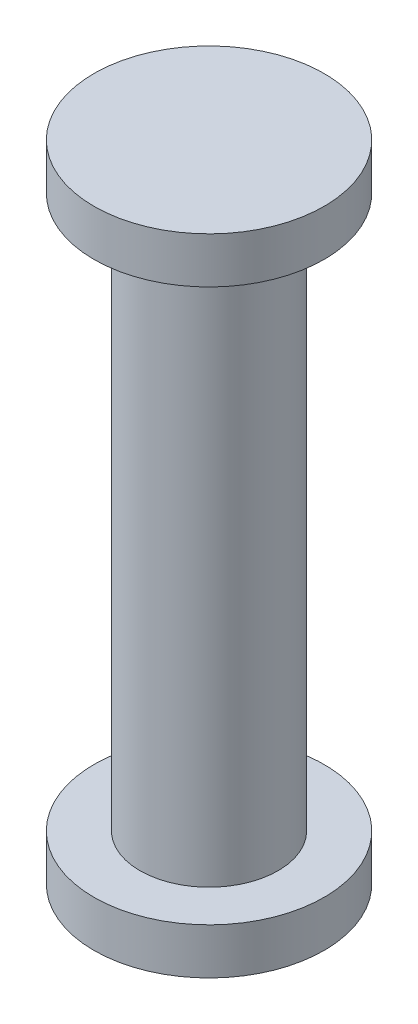
ISO-10303-21;
HEADER;
FILE_DESCRIPTION(('STEP AP214'),'2;1');
FILE_NAME('part.step','',(''),(''),'','','');
FILE_SCHEMA(('AUTOMOTIVE_DESIGN { 1 0 10303 214 1 1 1 1 }'));
ENDSEC;
DATA;
#1=APPLICATION_CONTEXT('core data for automotive mechanical design processes');
#2=APPLICATION_PROTOCOL_DEFINITION('international standard','automotive_design',2000,#1);
#3=PRODUCT_CONTEXT('',#1,'mechanical');
#4=PRODUCT('Part','Part','',(#3));
#5=PRODUCT_RELATED_PRODUCT_CATEGORY('part','',(#4));
#6=PRODUCT_DEFINITION_FORMATION('','',#4);
#7=PRODUCT_DEFINITION_CONTEXT('part definition',#1,'design');
#8=PRODUCT_DEFINITION('design','',#6,#7);
#9=PRODUCT_DEFINITION_SHAPE('','',#8);
#10=(LENGTH_UNIT() NAMED_UNIT(*) SI_UNIT(.MILLI.,.METRE.));
#11=(NAMED_UNIT(*) PLANE_ANGLE_UNIT() SI_UNIT($,.RADIAN.));
#12=(NAMED_UNIT(*) SI_UNIT($,.STERADIAN.) SOLID_ANGLE_UNIT());
#13=UNCERTAINTY_MEASURE_WITH_UNIT(LENGTH_MEASURE(1.E-05),#10,'distance_accuracy_value','');
#14=(GEOMETRIC_REPRESENTATION_CONTEXT(3) GLOBAL_UNCERTAINTY_ASSIGNED_CONTEXT((#13)) GLOBAL_UNIT_ASSIGNED_CONTEXT((#10,
#11,#12)) REPRESENTATION_CONTEXT('',''));
#15=CARTESIAN_POINT('',(0.,0.,0.));
#16=DIRECTION('',(0.,0.,1.));
#17=DIRECTION('',(1.,0.,0.));
#18=AXIS2_PLACEMENT_3D('',#15,#16,#17);
#19=CARTESIAN_POINT('',(0.,1.,0.));
#20=DIRECTION('',(0.,-1.,0.));
#21=DIRECTION('',(0.,0.,-1.));
#22=AXIS2_PLACEMENT_3D('',#19,#20,#21);
#23=CYLINDRICAL_SURFACE('',#22,2.5);
#24=CARTESIAN_POINT('',(0.,1.,0.));
#25=DIRECTION('',(0.,1.,0.));
#26=DIRECTION('',(0.,0.,1.));
#27=AXIS2_PLACEMENT_3D('',#24,#25,#26);
#28=CIRCLE('',#27,2.5);
#29=CARTESIAN_POINT('',(0.,1.,2.5));
#30=VERTEX_POINT('',#29);
#31=EDGE_CURVE('E45',#30,#30,#28,.T.);
#32=ORIENTED_EDGE('',*,*,#31,.F.);
#33=EDGE_LOOP('',(#32));
#34=FACE_BOUND('',#33,.T.);
#35=CARTESIAN_POINT('',(0.,0.,0.));
#36=DIRECTION('',(0.,1.,0.));
#37=DIRECTION('',(0.,0.,1.));
#38=AXIS2_PLACEMENT_3D('',#35,#36,#37);
#39=CIRCLE('',#38,2.5);
#40=CARTESIAN_POINT('',(0.,0.,2.5));
#41=VERTEX_POINT('',#40);
#42=EDGE_CURVE('E40',#41,#41,#39,.T.);
#43=ORIENTED_EDGE('',*,*,#42,.T.);
#44=EDGE_LOOP('',(#43));
#45=FACE_BOUND('',#44,.T.);
#46=ADVANCED_FACE('F37',(#34,#45),#23,.T.);
#47=CARTESIAN_POINT('',(0.,1.,0.));
#48=DIRECTION('',(0.,1.,0.));
#49=DIRECTION('',(0.,0.,1.));
#50=AXIS2_PLACEMENT_3D('',#47,#48,#49);
#51=PLANE('',#50);
#52=CARTESIAN_POINT('',(0.,1.,0.));
#53=DIRECTION('',(0.,1.,0.));
#54=DIRECTION('',(0.,0.,1.));
#55=AXIS2_PLACEMENT_3D('',#52,#53,#54);
#56=CIRCLE('',#55,1.5);
#57=CARTESIAN_POINT('',(0.,1.,1.5));
#58=VERTEX_POINT('',#57);
#59=EDGE_CURVE('E10',#58,#58,#56,.T.);
#60=ORIENTED_EDGE('',*,*,#59,.F.);
#61=EDGE_LOOP('',(#60));
#62=FACE_BOUND('',#61,.T.);
#63=ORIENTED_EDGE('',*,*,#31,.T.);
#64=EDGE_LOOP('',(#63));
#65=FACE_BOUND('',#64,.T.);
#66=ADVANCED_FACE('F83',(#62,#65),#51,.T.);
#67=CARTESIAN_POINT('',(0.,0.,0.));
#68=DIRECTION('',(0.,1.,0.));
#69=DIRECTION('',(0.,0.,1.));
#70=AXIS2_PLACEMENT_3D('',#67,#68,#69);
#71=PLANE('',#70);
#72=ORIENTED_EDGE('',*,*,#42,.F.);
#73=EDGE_LOOP('',(#72));
#74=FACE_BOUND('',#73,.T.);
#75=ADVANCED_FACE('F88',(#74),#71,.F.);
#76=CARTESIAN_POINT('',(0.,13.,0.));
#77=DIRECTION('',(0.,-1.,0.));
#78=DIRECTION('',(0.,0.,-1.));
#79=AXIS2_PLACEMENT_3D('',#76,#77,#78);
#80=CYLINDRICAL_SURFACE('',#79,1.5);
#81=CARTESIAN_POINT('',(0.,13.,0.));
#82=DIRECTION('',(0.,1.,0.));
#83=DIRECTION('',(0.,0.,1.));
#84=AXIS2_PLACEMENT_3D('',#81,#82,#83);
#85=CIRCLE('',#84,1.5);
#86=CARTESIAN_POINT('',(0.,13.,1.5));
#87=VERTEX_POINT('',#86);
#88=EDGE_CURVE('E52',#87,#87,#85,.T.);
#89=ORIENTED_EDGE('',*,*,#88,.F.);
#90=EDGE_LOOP('',(#89));
#91=FACE_BOUND('',#90,.T.);
#92=ORIENTED_EDGE('',*,*,#59,.T.);
#93=EDGE_LOOP('',(#92));
#94=FACE_BOUND('',#93,.T.);
#95=ADVANCED_FACE('F70',(#91,#94),#80,.T.);
#96=CARTESIAN_POINT('',(0.,14.,0.));
#97=DIRECTION('',(0.,-1.,0.));
#98=DIRECTION('',(0.,0.,-1.));
#99=AXIS2_PLACEMENT_3D('',#96,#97,#98);
#100=CYLINDRICAL_SURFACE('',#99,2.5);
#101=CARTESIAN_POINT('',(0.,14.,0.));
#102=DIRECTION('',(0.,1.,0.));
#103=DIRECTION('',(0.,0.,1.));
#104=AXIS2_PLACEMENT_3D('',#101,#102,#103);
#105=CIRCLE('',#104,2.5);
#106=CARTESIAN_POINT('',(0.,14.,2.5));
#107=VERTEX_POINT('',#106);
#108=EDGE_CURVE('E56',#107,#107,#105,.T.);
#109=ORIENTED_EDGE('',*,*,#108,.F.);
#110=EDGE_LOOP('',(#109));
#111=FACE_BOUND('',#110,.T.);
#112=CARTESIAN_POINT('',(0.,13.,0.));
#113=DIRECTION('',(0.,1.,0.));
#114=DIRECTION('',(0.,0.,1.));
#115=AXIS2_PLACEMENT_3D('',#112,#113,#114);
#116=CIRCLE('',#115,2.5);
#117=CARTESIAN_POINT('',(0.,13.,2.5));
#118=VERTEX_POINT('',#117);
#119=EDGE_CURVE('E57',#118,#118,#116,.T.);
#120=ORIENTED_EDGE('',*,*,#119,.T.);
#121=EDGE_LOOP('',(#120));
#122=FACE_BOUND('',#121,.T.);
#123=ADVANCED_FACE('F67',(#111,#122),#100,.T.);
#124=CARTESIAN_POINT('',(0.,14.,0.));
#125=DIRECTION('',(0.,1.,0.));
#126=DIRECTION('',(0.,0.,1.));
#127=AXIS2_PLACEMENT_3D('',#124,#125,#126);
#128=PLANE('',#127);
#129=ORIENTED_EDGE('',*,*,#108,.T.);
#130=EDGE_LOOP('',(#129));
#131=FACE_BOUND('',#130,.T.);
#132=ADVANCED_FACE('F65',(#131),#128,.T.);
#133=CARTESIAN_POINT('',(0.,13.,0.));
#134=DIRECTION('',(0.,1.,0.));
#135=DIRECTION('',(0.,0.,1.));
#136=AXIS2_PLACEMENT_3D('',#133,#134,#135);
#137=PLANE('',#136);
#138=ORIENTED_EDGE('',*,*,#88,.T.);
#139=EDGE_LOOP('',(#138));
#140=FACE_BOUND('',#139,.T.);
#141=ORIENTED_EDGE('',*,*,#119,.F.);
#142=EDGE_LOOP('',(#141));
#143=FACE_BOUND('',#142,.T.);
#144=ADVANCED_FACE('F74',(#140,#143),#137,.F.);
#145=CLOSED_SHELL('',(#46,#66,#75,#95,#123,#132,#144));
#146=MANIFOLD_SOLID_BREP('B2',#145);
#147=ADVANCED_BREP_SHAPE_REPRESENTATION('',(#18,#146),#14);
#148=SHAPE_DEFINITION_REPRESENTATION(#9,#147);
ENDSEC;
END-ISO-10303-21;
